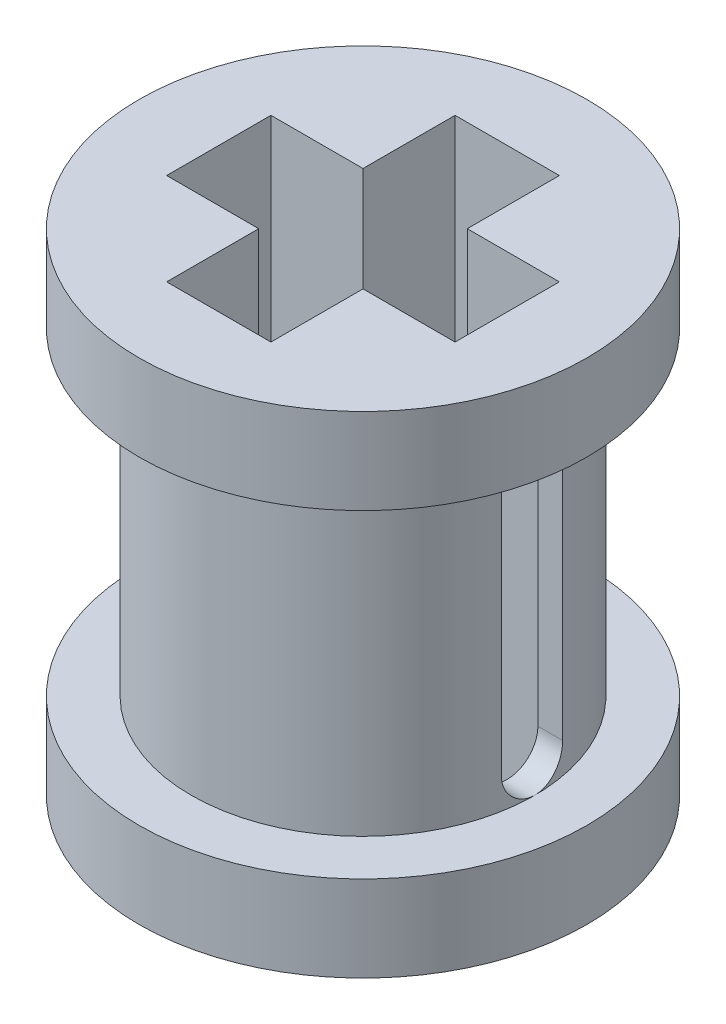
ISO-10303-21;
HEADER;
FILE_DESCRIPTION(('STEP AP214'),'2;1');
FILE_NAME('part.step','',(''),(''),'','','');
FILE_SCHEMA(('AUTOMOTIVE_DESIGN { 1 0 10303 214 1 1 1 1 }'));
ENDSEC;
DATA;
#1=APPLICATION_CONTEXT('core data for automotive mechanical design processes');
#2=APPLICATION_PROTOCOL_DEFINITION('international standard','automotive_design',2000,#1);
#3=PRODUCT_CONTEXT('',#1,'mechanical');
#4=PRODUCT('Part','Part','',(#3));
#5=PRODUCT_RELATED_PRODUCT_CATEGORY('part','',(#4));
#6=PRODUCT_DEFINITION_FORMATION('','',#4);
#7=PRODUCT_DEFINITION_CONTEXT('part definition',#1,'design');
#8=PRODUCT_DEFINITION('design','',#6,#7);
#9=PRODUCT_DEFINITION_SHAPE('','',#8);
#10=(LENGTH_UNIT() NAMED_UNIT(*) SI_UNIT(.MILLI.,.METRE.));
#11=(NAMED_UNIT(*) PLANE_ANGLE_UNIT() SI_UNIT($,.RADIAN.));
#12=(NAMED_UNIT(*) SI_UNIT($,.STERADIAN.) SOLID_ANGLE_UNIT());
#13=UNCERTAINTY_MEASURE_WITH_UNIT(LENGTH_MEASURE(1.E-05),#10,'distance_accuracy_value','');
#14=(GEOMETRIC_REPRESENTATION_CONTEXT(3) GLOBAL_UNCERTAINTY_ASSIGNED_CONTEXT((#13)) GLOBAL_UNIT_ASSIGNED_CONTEXT((#10,
#11,#12)) REPRESENTATION_CONTEXT('',''));
#15=CARTESIAN_POINT('',(0.,0.,0.));
#16=DIRECTION('',(0.,0.,1.));
#17=DIRECTION('',(1.,0.,0.));
#18=AXIS2_PLACEMENT_3D('',#15,#16,#17);
#19=CARTESIAN_POINT('',(0.,1.4,0.));
#20=DIRECTION('',(0.,-1.,0.));
#21=DIRECTION('',(0.,0.,-1.));
#22=AXIS2_PLACEMENT_3D('',#19,#20,#21);
#23=CYLINDRICAL_SURFACE('',#22,3.65);
#24=CARTESIAN_POINT('',(0.,1.4,0.));
#25=DIRECTION('',(0.,1.,0.));
#26=DIRECTION('',(0.,0.,1.));
#27=AXIS2_PLACEMENT_3D('',#24,#25,#26);
#28=CIRCLE('',#27,3.65);
#29=CARTESIAN_POINT('',(0.,1.4,3.65));
#30=VERTEX_POINT('',#29);
#31=EDGE_CURVE('E368',#30,#30,#28,.T.);
#32=ORIENTED_EDGE('',*,*,#31,.F.);
#33=EDGE_LOOP('',(#32));
#34=FACE_BOUND('',#33,.T.);
#35=CARTESIAN_POINT('',(0.,0.,0.));
#36=DIRECTION('',(0.,1.,0.));
#37=DIRECTION('',(0.,0.,1.));
#38=AXIS2_PLACEMENT_3D('',#35,#36,#37);
#39=CIRCLE('',#38,3.65);
#40=CARTESIAN_POINT('',(0.,0.,3.65));
#41=VERTEX_POINT('',#40);
#42=EDGE_CURVE('E371',#41,#41,#39,.T.);
#43=ORIENTED_EDGE('',*,*,#42,.T.);
#44=EDGE_LOOP('',(#43));
#45=FACE_BOUND('',#44,.T.);
#46=ADVANCED_FACE('F104',(#34,#45),#23,.T.);
#47=CARTESIAN_POINT('',(0.,1.4,0.));
#48=DIRECTION('',(0.,1.,0.));
#49=DIRECTION('',(0.,0.,1.));
#50=AXIS2_PLACEMENT_3D('',#47,#48,#49);
#51=PLANE('',#50);
#52=CARTESIAN_POINT('',(0.,1.4,0.));
#53=DIRECTION('',(0.,1.,0.));
#54=DIRECTION('',(0.,0.,1.));
#55=AXIS2_PLACEMENT_3D('',#52,#53,#54);
#56=CIRCLE('',#55,2.8);
#57=CARTESIAN_POINT('',(0.,1.4,2.8));
#58=VERTEX_POINT('',#57);
#59=EDGE_CURVE('E375',#58,#58,#56,.T.);
#60=ORIENTED_EDGE('',*,*,#59,.F.);
#61=EDGE_LOOP('',(#60));
#62=FACE_BOUND('',#61,.T.);
#63=ORIENTED_EDGE('',*,*,#31,.T.);
#64=EDGE_LOOP('',(#63));
#65=FACE_BOUND('',#64,.T.);
#66=ADVANCED_FACE('F359',(#62,#65),#51,.T.);
#67=CARTESIAN_POINT('',(0.,0.,0.));
#68=DIRECTION('',(0.,1.,0.));
#69=DIRECTION('',(0.,0.,1.));
#70=AXIS2_PLACEMENT_3D('',#67,#68,#69);
#71=PLANE('',#70);
#72=DIRECTION('',(1.,0.,0.));
#73=VECTOR('',#72,1.);
#74=CARTESIAN_POINT('',(0.,0.,-0.85));
#75=LINE('',#74,#73);
#76=CARTESIAN_POINT('',(-2.35106358910175,0.,-0.85));
#77=VERTEX_POINT('',#76);
#78=CARTESIAN_POINT('',(-0.85,0.,-0.85));
#79=VERTEX_POINT('',#78);
#80=EDGE_CURVE('E531',#77,#79,#75,.T.);
#81=ORIENTED_EDGE('',*,*,#80,.F.);
#82=DIRECTION('',(0.,0.,1.));
#83=VECTOR('',#82,1.);
#84=CARTESIAN_POINT('',(-2.35106358910175,0.,0.));
#85=LINE('',#84,#83);
#86=CARTESIAN_POINT('',(-2.35106358910175,0.,0.85));
#87=VERTEX_POINT('',#86);
#88=EDGE_CURVE('E528',#77,#87,#85,.T.);
#89=ORIENTED_EDGE('',*,*,#88,.T.);
#90=DIRECTION('',(1.,0.,0.));
#91=VECTOR('',#90,1.);
#92=CARTESIAN_POINT('',(0.,0.,0.85));
#93=LINE('',#92,#91);
#94=CARTESIAN_POINT('',(-0.85,0.,0.85));
#95=VERTEX_POINT('',#94);
#96=EDGE_CURVE('E525',#87,#95,#93,.T.);
#97=ORIENTED_EDGE('',*,*,#96,.T.);
#98=DIRECTION('',(0.,0.,-1.));
#99=VECTOR('',#98,1.);
#100=CARTESIAN_POINT('',(-0.85,0.,0.));
#101=LINE('',#100,#99);
#102=CARTESIAN_POINT('',(-0.85,0.,2.35106358910175));
#103=VERTEX_POINT('',#102);
#104=EDGE_CURVE('E523',#103,#95,#101,.T.);
#105=ORIENTED_EDGE('',*,*,#104,.F.);
#106=DIRECTION('',(-1.,0.,0.));
#107=VECTOR('',#106,1.);
#108=CARTESIAN_POINT('',(0.,0.,2.35106358910175));
#109=LINE('',#108,#107);
#110=CARTESIAN_POINT('',(0.85,0.,2.35106358910175));
#111=VERTEX_POINT('',#110);
#112=EDGE_CURVE('E464',#111,#103,#109,.T.);
#113=ORIENTED_EDGE('',*,*,#112,.F.);
#114=DIRECTION('',(0.,0.,-1.));
#115=VECTOR('',#114,1.);
#116=CARTESIAN_POINT('',(0.85,0.,0.));
#117=LINE('',#116,#115);
#118=CARTESIAN_POINT('',(0.85,0.,0.85));
#119=VERTEX_POINT('',#118);
#120=EDGE_CURVE('E489',#111,#119,#117,.T.);
#121=ORIENTED_EDGE('',*,*,#120,.T.);
#122=DIRECTION('',(1.,0.,0.));
#123=VECTOR('',#122,1.);
#124=CARTESIAN_POINT('',(0.,0.,0.85));
#125=LINE('',#124,#123);
#126=CARTESIAN_POINT('',(2.35106358910175,0.,0.85));
#127=VERTEX_POINT('',#126);
#128=EDGE_CURVE('E545',#119,#127,#125,.T.);
#129=ORIENTED_EDGE('',*,*,#128,.T.);
#130=DIRECTION('',(0.,0.,1.));
#131=VECTOR('',#130,1.);
#132=CARTESIAN_POINT('',(2.35106358910175,0.,0.));
#133=LINE('',#132,#131);
#134=CARTESIAN_POINT('',(2.35106358910175,0.,-0.85));
#135=VERTEX_POINT('',#134);
#136=EDGE_CURVE('E543',#135,#127,#133,.T.);
#137=ORIENTED_EDGE('',*,*,#136,.F.);
#138=DIRECTION('',(1.,0.,0.));
#139=VECTOR('',#138,1.);
#140=CARTESIAN_POINT('',(0.,0.,-0.85));
#141=LINE('',#140,#139);
#142=CARTESIAN_POINT('',(0.85,0.,-0.85));
#143=VERTEX_POINT('',#142);
#144=EDGE_CURVE('E541',#143,#135,#141,.T.);
#145=ORIENTED_EDGE('',*,*,#144,.F.);
#146=DIRECTION('',(0.,0.,-1.));
#147=VECTOR('',#146,1.);
#148=CARTESIAN_POINT('',(0.85,0.,0.));
#149=LINE('',#148,#147);
#150=CARTESIAN_POINT('',(0.85,0.,-2.35106358910175));
#151=VERTEX_POINT('',#150);
#152=EDGE_CURVE('E538',#143,#151,#149,.T.);
#153=ORIENTED_EDGE('',*,*,#152,.T.);
#154=DIRECTION('',(-1.,0.,0.));
#155=VECTOR('',#154,1.);
#156=CARTESIAN_POINT('',(0.,0.,-2.35106358910175));
#157=LINE('',#156,#155);
#158=CARTESIAN_POINT('',(-0.85,0.,-2.35106358910175));
#159=VERTEX_POINT('',#158);
#160=EDGE_CURVE('E535',#151,#159,#157,.T.);
#161=ORIENTED_EDGE('',*,*,#160,.T.);
#162=DIRECTION('',(0.,0.,-1.));
#163=VECTOR('',#162,1.);
#164=CARTESIAN_POINT('',(-0.85,0.,0.));
#165=LINE('',#164,#163);
#166=EDGE_CURVE('E533',#79,#159,#165,.T.);
#167=ORIENTED_EDGE('',*,*,#166,.F.);
#168=EDGE_LOOP('',(#81,#89,#97,#105,#113,#121,#129,#137,#145,#153,#161,#167));
#169=FACE_BOUND('',#168,.T.);
#170=ORIENTED_EDGE('',*,*,#42,.F.);
#171=EDGE_LOOP('',(#170));
#172=FACE_BOUND('',#171,.T.);
#173=ADVANCED_FACE('F355',(#169,#172),#71,.F.);
#174=CARTESIAN_POINT('',(0.,6.6,0.));
#175=DIRECTION('',(0.,-1.,0.));
#176=DIRECTION('',(0.,0.,-1.));
#177=AXIS2_PLACEMENT_3D('',#174,#175,#176);
#178=CYLINDRICAL_SURFACE('',#177,2.8);
#179=DIRECTION('',(0.,-1.,0.));
#180=VECTOR('',#179,1.);
#181=CARTESIAN_POINT('',(-2.75499546279118,6.6,-0.499999999999999));
#182=LINE('',#181,#180);
#183=CARTESIAN_POINT('',(-2.75499546279118,1.90133463433287,-0.5));
#184=VERTEX_POINT('',#183);
#185=CARTESIAN_POINT('',(-2.75499546279118,6.09866536566713,-0.499999999999999));
#186=VERTEX_POINT('',#185);
#187=EDGE_CURVE('E261',#184,#186,#182,.F.);
#188=ORIENTED_EDGE('',*,*,#187,.T.);
#189=CARTESIAN_POINT('',(-2.75499546279118,6.09866536566713,-0.499999999999999));
#190=CARTESIAN_POINT('',(-2.75497887205901,6.12655658347319,-0.500024938224864));
#191=CARTESIAN_POINT('',(-2.7554185685824,6.15443554412663,-0.497667853212735));
#192=CARTESIAN_POINT('',(-2.75708629996074,6.20935838189249,-0.488379825856461));
#193=CARTESIAN_POINT('',(-2.75831323259685,6.23640337125773,-0.481455278093242));
#194=CARTESIAN_POINT('',(-2.7614321277351,6.28893474667129,-0.46321988039961));
#195=CARTESIAN_POINT('',(-2.76332421195943,6.31442084644124,-0.451908227593429));
#196=CARTESIAN_POINT('',(-2.76755431171236,6.36313611251217,-0.425236441375134));
#197=CARTESIAN_POINT('',(-2.76989234667835,6.38636518037061,-0.40987613148546));
#198=CARTESIAN_POINT('',(-2.77478135288023,6.43016382949557,-0.375358591948535));
#199=CARTESIAN_POINT('',(-2.77733422045528,6.4507044783249,-0.356164912754774));
#200=CARTESIAN_POINT('',(-2.78234840445687,6.4882938941979,-0.314602640152096));
#201=CARTESIAN_POINT('',(-2.78480970675806,6.50534212429504,-0.292233559430573));
#202=CARTESIAN_POINT('',(-2.78938364020792,6.53557114060679,-0.244766016599119));
#203=CARTESIAN_POINT('',(-2.79149376054344,6.5487245606168,-0.219649863971788));
#204=CARTESIAN_POINT('',(-2.79510610672799,6.57061380439711,-0.167521833705497));
#205=CARTESIAN_POINT('',(-2.79660841194082,6.57935020494486,-0.140510204104075));
#206=CARTESIAN_POINT('',(-2.79882254164239,6.59206858906919,-0.0856590585031865));
#207=CARTESIAN_POINT('',(-2.79954253765568,6.59609975432187,-0.0578312816256739));
#208=CARTESIAN_POINT('',(-2.80013905725202,6.59944636675769,-0.00188501169272974));
#209=CARTESIAN_POINT('',(-2.80001562639277,6.59876206864656,0.0262334655786034));
#210=CARTESIAN_POINT('',(-2.79894559054094,6.5927350053538,0.0816246904800355));
#211=CARTESIAN_POINT('',(-2.79800836309283,6.58744530727771,0.108903419510395));
#212=CARTESIAN_POINT('',(-2.79542653943881,6.57244140100535,0.162179577457163));
#213=CARTESIAN_POINT('',(-2.79378192400253,6.56272707252498,0.188176971519039));
#214=CARTESIAN_POINT('',(-2.78995427620722,6.53909796549474,0.238308749814554));
#215=CARTESIAN_POINT('',(-2.78776848935476,6.5251616136037,0.262432746718429));
#216=CARTESIAN_POINT('',(-2.78310083586276,6.4935003774328,0.308018795350735));
#217=CARTESIAN_POINT('',(-2.78061895233085,6.47577527695843,0.329480695063438));
#218=CARTESIAN_POINT('',(-2.77559395801606,6.43674910195716,0.369445762315454));
#219=CARTESIAN_POINT('',(-2.77305047493893,6.41540205799158,0.387904016098364));
#220=CARTESIAN_POINT('',(-2.76822113622519,6.36988366146683,0.420989630724439));
#221=CARTESIAN_POINT('',(-2.76593535332235,6.34571151544674,0.435615911558823));
#222=CARTESIAN_POINT('',(-2.76187947153686,6.29516937063141,0.460633643725038));
#223=CARTESIAN_POINT('',(-2.7601104088113,6.26879509025315,0.471016602511347));
#224=CARTESIAN_POINT('',(-2.75730426277419,6.2146556408155,0.487177194202711));
#225=CARTESIAN_POINT('',(-2.7562660871395,6.18689261406202,0.492961701250494));
#226=CARTESIAN_POINT('',(-2.75543456740347,6.1488731677646,0.497575256053474));
#227=CARTESIAN_POINT('',(-2.75527006132675,6.13884502843584,0.498484893948501));
#228=CARTESIAN_POINT('',(-2.75505061343132,6.11876785872478,0.499696483824883));
#229=CARTESIAN_POINT('',(-2.75499548747878,6.10871889200859,0.499999457091805));
#230=CARTESIAN_POINT('',(-2.75499546279119,6.09866536566713,0.5));
#231=B_SPLINE_CURVE_WITH_KNOTS('',3,(#189,#190,#191,#192,#193,#194,#195,#196,#197,#198,#199,
#200,#201,#202,#203,#204,#205,#206,#207,#208,#209,#210,#211,#212,#213,#214,#215,#216,#217,#218,
#219,#220,#221,#222,#223,#224,#225,#226,#227,#228,#229,#230),.UNSPECIFIED.,.F.,.F.,(4,2,2,2,2,2,
2,2,2,2,2,2,2,2,2,2,2,2,2,2,4),(0.,0.0835523080036198,0.166987887921846,0.250438744437804,
0.333893239108228,0.418182670449917,0.502485051271318,0.587366429986767,0.672236721968821,
0.756211725962619,0.84018219408281,0.923197704714185,1.00621547226653,1.08966480414763,
1.17311889910675,1.25772456770494,1.34235405609703,1.42715210133808,1.5118231438752,
1.542020788702,1.57216755461931),.UNSPECIFIED.);
#232=CARTESIAN_POINT('',(-2.75499546279118,6.09866536566713,0.5));
#233=VERTEX_POINT('',#232);
#234=EDGE_CURVE('E251',#186,#233,#231,.T.);
#235=ORIENTED_EDGE('',*,*,#234,.T.);
#236=DIRECTION('',(0.,-1.,0.));
#237=VECTOR('',#236,1.);
#238=CARTESIAN_POINT('',(-2.75499546279118,6.6,0.5));
#239=LINE('',#238,#237);
#240=CARTESIAN_POINT('',(-2.75499546279118,1.90133463433287,0.5));
#241=VERTEX_POINT('',#240);
#242=EDGE_CURVE('E237',#233,#241,#239,.T.);
#243=ORIENTED_EDGE('',*,*,#242,.T.);
#244=CARTESIAN_POINT('',(-2.75499546279118,1.90133463433287,0.499999999999999));
#245=CARTESIAN_POINT('',(-2.75497887205901,1.87344341652681,0.500024938224864));
#246=CARTESIAN_POINT('',(-2.7554185685824,1.84556445587337,0.497667853212736));
#247=CARTESIAN_POINT('',(-2.75708629996074,1.79064161810751,0.488379825856461));
#248=CARTESIAN_POINT('',(-2.75831323259685,1.76359662874227,0.481455278093242));
#249=CARTESIAN_POINT('',(-2.7614321277351,1.71106525332871,0.46321988039961));
#250=CARTESIAN_POINT('',(-2.76332421195943,1.68557915355876,0.451908227593429));
#251=CARTESIAN_POINT('',(-2.76755431171236,1.63686388748783,0.425236441375134));
#252=CARTESIAN_POINT('',(-2.76989234667835,1.61363481962939,0.40987613148546));
#253=CARTESIAN_POINT('',(-2.77478135288023,1.56983617050443,0.375358591948535));
#254=CARTESIAN_POINT('',(-2.77733422045528,1.5492955216751,0.356164912754774));
#255=CARTESIAN_POINT('',(-2.78234840445687,1.51170610580211,0.314602640152096));
#256=CARTESIAN_POINT('',(-2.78480970675806,1.49465787570496,0.292233559430573));
#257=CARTESIAN_POINT('',(-2.78938364020792,1.46442885939321,0.244766016599119));
#258=CARTESIAN_POINT('',(-2.79149376054344,1.4512754393832,0.219649863971788));
#259=CARTESIAN_POINT('',(-2.79510610672799,1.42938619560289,0.167521833705497));
#260=CARTESIAN_POINT('',(-2.79660841194082,1.42064979505514,0.140510204104075));
#261=CARTESIAN_POINT('',(-2.79882254164239,1.40793141093081,0.0856590585031866));
#262=CARTESIAN_POINT('',(-2.79954253765568,1.40390024567813,0.0578312816256741));
#263=CARTESIAN_POINT('',(-2.80013905725202,1.40055363324231,0.00188501169272991));
#264=CARTESIAN_POINT('',(-2.80001562639277,1.40123793135344,-0.0262334655786032));
#265=CARTESIAN_POINT('',(-2.79894559054094,1.4072649946462,-0.0816246904800353));
#266=CARTESIAN_POINT('',(-2.79800836309283,1.41255469272229,-0.108903419510395));
#267=CARTESIAN_POINT('',(-2.79542653943881,1.42755859899465,-0.162179577457163));
#268=CARTESIAN_POINT('',(-2.79378192400253,1.43727292747502,-0.188176971519039));
#269=CARTESIAN_POINT('',(-2.78995427620722,1.46090203450526,-0.238308749814554));
#270=CARTESIAN_POINT('',(-2.78776848935476,1.4748383863963,-0.262432746718428));
#271=CARTESIAN_POINT('',(-2.78310083586276,1.5064996225672,-0.308018795350735));
#272=CARTESIAN_POINT('',(-2.78061895233085,1.52422472304157,-0.329480695063438));
#273=CARTESIAN_POINT('',(-2.77559395801606,1.56325089804284,-0.369445762315454));
#274=CARTESIAN_POINT('',(-2.77305047493893,1.58459794200842,-0.387904016098363));
#275=CARTESIAN_POINT('',(-2.76822113622519,1.63011633853317,-0.420989630724438));
#276=CARTESIAN_POINT('',(-2.76593535332235,1.65428848455325,-0.435615911558823));
#277=CARTESIAN_POINT('',(-2.76187947153686,1.70483062936859,-0.460633643725037));
#278=CARTESIAN_POINT('',(-2.7601104088113,1.73120490974686,-0.471016602511347));
#279=CARTESIAN_POINT('',(-2.75730426277419,1.7853443591845,-0.487177194202711));
#280=CARTESIAN_POINT('',(-2.7562660871395,1.81310738593798,-0.492961701250494));
#281=CARTESIAN_POINT('',(-2.75543456740347,1.8511268322354,-0.497575256053474));
#282=CARTESIAN_POINT('',(-2.75527006132675,1.86115497156416,-0.498484893948501));
#283=CARTESIAN_POINT('',(-2.75505061343132,1.88123214127522,-0.499696483824883));
#284=CARTESIAN_POINT('',(-2.75499548747878,1.89128110799141,-0.499999457091805));
#285=CARTESIAN_POINT('',(-2.75499546279119,1.90133463433287,-0.5));
#286=B_SPLINE_CURVE_WITH_KNOTS('',3,(#244,#245,#246,#247,#248,#249,#250,#251,#252,#253,#254,
#255,#256,#257,#258,#259,#260,#261,#262,#263,#264,#265,#266,#267,#268,#269,#270,#271,#272,#273,
#274,#275,#276,#277,#278,#279,#280,#281,#282,#283,#284,#285),.UNSPECIFIED.,.F.,.F.,(4,2,2,2,2,2,
2,2,2,2,2,2,2,2,2,2,2,2,2,2,4),(0.,0.0835523080036202,0.166987887921846,0.250438744437804,
0.333893239108228,0.418182670449917,0.502485051271318,0.587366429986766,0.672236721968821,
0.756211725962619,0.84018219408281,0.923197704714185,1.00621547226653,1.08966480414763,
1.17311889910675,1.25772456770494,1.34235405609703,1.42715210133808,1.5118231438752,
1.54202078870201,1.57216755461931),.UNSPECIFIED.);
#287=EDGE_CURVE('E415',#241,#184,#286,.T.);
#288=ORIENTED_EDGE('',*,*,#287,.T.);
#289=EDGE_LOOP('',(#188,#235,#243,#288));
#290=FACE_BOUND('',#289,.T.);
#291=DIRECTION('',(0.,-1.,0.));
#292=VECTOR('',#291,1.);
#293=CARTESIAN_POINT('',(2.75499546279118,6.6,0.5));
#294=LINE('',#293,#292);
#295=CARTESIAN_POINT('',(2.75499546279118,1.90133463433287,0.499999999999999));
#296=VERTEX_POINT('',#295);
#297=CARTESIAN_POINT('',(2.75499546279118,6.09866536566713,0.5));
#298=VERTEX_POINT('',#297);
#299=EDGE_CURVE('E246',#296,#298,#294,.F.);
#300=ORIENTED_EDGE('',*,*,#299,.T.);
#301=CARTESIAN_POINT('',(2.75499546279118,6.09866536566713,0.499999999999999));
#302=CARTESIAN_POINT('',(2.75497887205901,6.12655658347319,0.500024938224864));
#303=CARTESIAN_POINT('',(2.7554185685824,6.15443554412663,0.497667853212735));
#304=CARTESIAN_POINT('',(2.75708629996074,6.20935838189249,0.488379825856461));
#305=CARTESIAN_POINT('',(2.75831323259685,6.23640337125773,0.481455278093242));
#306=CARTESIAN_POINT('',(2.7614321277351,6.28893474667129,0.46321988039961));
#307=CARTESIAN_POINT('',(2.76332421195943,6.31442084644124,0.451908227593429));
#308=CARTESIAN_POINT('',(2.76755431171236,6.36313611251217,0.425236441375134));
#309=CARTESIAN_POINT('',(2.76989234667835,6.38636518037061,0.40987613148546));
#310=CARTESIAN_POINT('',(2.77478135288023,6.43016382949557,0.375358591948535));
#311=CARTESIAN_POINT('',(2.77733422045528,6.4507044783249,0.356164912754774));
#312=CARTESIAN_POINT('',(2.78234840445687,6.4882938941979,0.314602640152096));
#313=CARTESIAN_POINT('',(2.78480970675806,6.50534212429504,0.292233559430573));
#314=CARTESIAN_POINT('',(2.78938364020792,6.53557114060679,0.244766016599119));
#315=CARTESIAN_POINT('',(2.79149376054344,6.5487245606168,0.219649863971788));
#316=CARTESIAN_POINT('',(2.79510610672799,6.57061380439711,0.167521833705497));
#317=CARTESIAN_POINT('',(2.79660841194082,6.57935020494486,0.140510204104075));
#318=CARTESIAN_POINT('',(2.79882254164239,6.59206858906919,0.0856590585031865));
#319=CARTESIAN_POINT('',(2.79954253765568,6.59609975432187,0.0578312816256739));
#320=CARTESIAN_POINT('',(2.80013905725202,6.59944636675769,0.00188501169272974));
#321=CARTESIAN_POINT('',(2.80001562639277,6.59876206864656,-0.0262334655786034));
#322=CARTESIAN_POINT('',(2.79894559054094,6.5927350053538,-0.0816246904800355));
#323=CARTESIAN_POINT('',(2.79800836309283,6.58744530727771,-0.108903419510395));
#324=CARTESIAN_POINT('',(2.79542653943881,6.57244140100535,-0.162179577457163));
#325=CARTESIAN_POINT('',(2.79378192400253,6.56272707252498,-0.188176971519039));
#326=CARTESIAN_POINT('',(2.78995427620722,6.53909796549474,-0.238308749814554));
#327=CARTESIAN_POINT('',(2.78776848935476,6.5251616136037,-0.262432746718429));
#328=CARTESIAN_POINT('',(2.78310083586276,6.4935003774328,-0.308018795350735));
#329=CARTESIAN_POINT('',(2.78061895233085,6.47577527695843,-0.329480695063438));
#330=CARTESIAN_POINT('',(2.77559395801606,6.43674910195716,-0.369445762315454));
#331=CARTESIAN_POINT('',(2.77305047493893,6.41540205799158,-0.387904016098364));
#332=CARTESIAN_POINT('',(2.76822113622519,6.36988366146683,-0.420989630724439));
#333=CARTESIAN_POINT('',(2.76593535332235,6.34571151544674,-0.435615911558823));
#334=CARTESIAN_POINT('',(2.76187947153686,6.29516937063141,-0.460633643725038));
#335=CARTESIAN_POINT('',(2.7601104088113,6.26879509025315,-0.471016602511347));
#336=CARTESIAN_POINT('',(2.75730426277419,6.2146556408155,-0.487177194202711));
#337=CARTESIAN_POINT('',(2.7562660871395,6.18689261406202,-0.492961701250494));
#338=CARTESIAN_POINT('',(2.75543456740347,6.1488731677646,-0.497575256053474));
#339=CARTESIAN_POINT('',(2.75527006132675,6.13884502843584,-0.498484893948501));
#340=CARTESIAN_POINT('',(2.75505061343132,6.11876785872478,-0.499696483824883));
#341=CARTESIAN_POINT('',(2.75499548747878,6.10871889200859,-0.499999457091805));
#342=CARTESIAN_POINT('',(2.75499546279119,6.09866536566713,-0.5));
#343=B_SPLINE_CURVE_WITH_KNOTS('',3,(#301,#302,#303,#304,#305,#306,#307,#308,#309,#310,#311,
#312,#313,#314,#315,#316,#317,#318,#319,#320,#321,#322,#323,#324,#325,#326,#327,#328,#329,#330,
#331,#332,#333,#334,#335,#336,#337,#338,#339,#340,#341,#342),.UNSPECIFIED.,.F.,.F.,(4,2,2,2,2,2,
2,2,2,2,2,2,2,2,2,2,2,2,2,2,4),(0.,0.0835523080036198,0.166987887921846,0.250438744437804,
0.333893239108228,0.418182670449917,0.502485051271318,0.587366429986767,0.672236721968821,
0.756211725962619,0.84018219408281,0.923197704714185,1.00621547226653,1.08966480414763,
1.17311889910675,1.25772456770494,1.34235405609703,1.42715210133808,1.5118231438752,
1.542020788702,1.57216755461931),.UNSPECIFIED.);
#344=CARTESIAN_POINT('',(2.75499546279118,6.09866536566713,-0.499999999999999));
#345=VERTEX_POINT('',#344);
#346=EDGE_CURVE('E262',#298,#345,#343,.T.);
#347=ORIENTED_EDGE('',*,*,#346,.T.);
#348=DIRECTION('',(0.,-1.,0.));
#349=VECTOR('',#348,1.);
#350=CARTESIAN_POINT('',(2.75499546279118,6.6,-0.499999999999999));
#351=LINE('',#350,#349);
#352=CARTESIAN_POINT('',(2.75499546279118,1.90133463433287,-0.5));
#353=VERTEX_POINT('',#352);
#354=EDGE_CURVE('E267',#345,#353,#351,.T.);
#355=ORIENTED_EDGE('',*,*,#354,.T.);
#356=CARTESIAN_POINT('',(2.75499546279118,1.90133463433287,-0.499999999999999));
#357=CARTESIAN_POINT('',(2.75497887205901,1.87344341652681,-0.500024938224864));
#358=CARTESIAN_POINT('',(2.7554185685824,1.84556445587337,-0.497667853212736));
#359=CARTESIAN_POINT('',(2.75708629996074,1.79064161810751,-0.488379825856461));
#360=CARTESIAN_POINT('',(2.75831323259685,1.76359662874227,-0.481455278093242));
#361=CARTESIAN_POINT('',(2.7614321277351,1.71106525332871,-0.46321988039961));
#362=CARTESIAN_POINT('',(2.76332421195943,1.68557915355876,-0.451908227593429));
#363=CARTESIAN_POINT('',(2.76755431171236,1.63686388748783,-0.425236441375134));
#364=CARTESIAN_POINT('',(2.76989234667835,1.61363481962939,-0.40987613148546));
#365=CARTESIAN_POINT('',(2.77478135288023,1.56983617050443,-0.375358591948535));
#366=CARTESIAN_POINT('',(2.77733422045528,1.5492955216751,-0.356164912754774));
#367=CARTESIAN_POINT('',(2.78234840445687,1.51170610580211,-0.314602640152097));
#368=CARTESIAN_POINT('',(2.78480970675806,1.49465787570496,-0.292233559430573));
#369=CARTESIAN_POINT('',(2.78938364020792,1.46442885939321,-0.24476601659912));
#370=CARTESIAN_POINT('',(2.79149376054344,1.4512754393832,-0.219649863971789));
#371=CARTESIAN_POINT('',(2.79510610672799,1.42938619560289,-0.167521833705498));
#372=CARTESIAN_POINT('',(2.79660841194082,1.42064979505514,-0.140510204104075));
#373=CARTESIAN_POINT('',(2.79882254164239,1.40793141093081,-0.0856590585031872));
#374=CARTESIAN_POINT('',(2.79954253765568,1.40390024567813,-0.0578312816256746));
#375=CARTESIAN_POINT('',(2.80013905725202,1.40055363324231,-0.00188501169273041));
#376=CARTESIAN_POINT('',(2.80001562639277,1.40123793135344,0.0262334655786027));
#377=CARTESIAN_POINT('',(2.79894559054094,1.4072649946462,0.0816246904800348));
#378=CARTESIAN_POINT('',(2.79800836309283,1.41255469272229,0.108903419510394));
#379=CARTESIAN_POINT('',(2.79542653943881,1.42755859899465,0.162179577457163));
#380=CARTESIAN_POINT('',(2.79378192400253,1.43727292747502,0.188176971519038));
#381=CARTESIAN_POINT('',(2.78995427620722,1.46090203450526,0.238308749814554));
#382=CARTESIAN_POINT('',(2.78776848935476,1.4748383863963,0.262432746718428));
#383=CARTESIAN_POINT('',(2.78310083586276,1.5064996225672,0.308018795350734));
#384=CARTESIAN_POINT('',(2.78061895233085,1.52422472304157,0.329480695063437));
#385=CARTESIAN_POINT('',(2.77559395801606,1.56325089804284,0.369445762315453));
#386=CARTESIAN_POINT('',(2.77305047493893,1.58459794200842,0.387904016098363));
#387=CARTESIAN_POINT('',(2.76822113622519,1.63011633853317,0.420989630724438));
#388=CARTESIAN_POINT('',(2.76593535332235,1.65428848455325,0.435615911558822));
#389=CARTESIAN_POINT('',(2.76187947153686,1.70483062936859,0.460633643725037));
#390=CARTESIAN_POINT('',(2.7601104088113,1.73120490974685,0.471016602511347));
#391=CARTESIAN_POINT('',(2.75730426277419,1.7853443591845,0.487177194202711));
#392=CARTESIAN_POINT('',(2.7562660871395,1.81310738593798,0.492961701250494));
#393=CARTESIAN_POINT('',(2.75543456740347,1.8511268322354,0.497575256053474));
#394=CARTESIAN_POINT('',(2.75527006132675,1.86115497156416,0.498484893948501));
#395=CARTESIAN_POINT('',(2.75505061343132,1.88123214127522,0.499696483824883));
#396=CARTESIAN_POINT('',(2.75499548747878,1.89128110799141,0.499999457091805));
#397=CARTESIAN_POINT('',(2.75499546279119,1.90133463433287,0.5));
#398=B_SPLINE_CURVE_WITH_KNOTS('',3,(#356,#357,#358,#359,#360,#361,#362,#363,#364,#365,#366,
#367,#368,#369,#370,#371,#372,#373,#374,#375,#376,#377,#378,#379,#380,#381,#382,#383,#384,#385,
#386,#387,#388,#389,#390,#391,#392,#393,#394,#395,#396,#397),.UNSPECIFIED.,.F.,.F.,(4,2,2,2,2,2,
2,2,2,2,2,2,2,2,2,2,2,2,2,2,4),(0.,0.08355230800362,0.166987887921846,0.250438744437804,
0.333893239108228,0.418182670449916,0.502485051271317,0.587366429986766,0.672236721968821,
0.756211725962618,0.840182194082809,0.923197704714184,1.00621547226653,1.08966480414763,
1.17311889910675,1.25772456770494,1.34235405609703,1.42715210133808,1.5118231438752,
1.54202078870201,1.57216755461931),.UNSPECIFIED.);
#399=EDGE_CURVE('E402',#353,#296,#398,.T.);
#400=ORIENTED_EDGE('',*,*,#399,.T.);
#401=EDGE_LOOP('',(#300,#347,#355,#400));
#402=FACE_BOUND('',#401,.T.);
#403=CARTESIAN_POINT('',(0.,6.6,0.));
#404=DIRECTION('',(0.,1.,0.));
#405=DIRECTION('',(0.,0.,1.));
#406=AXIS2_PLACEMENT_3D('',#403,#404,#405);
#407=CIRCLE('',#406,2.8);
#408=CARTESIAN_POINT('',(0.,6.6,2.8));
#409=VERTEX_POINT('',#408);
#410=EDGE_CURVE('E373',#409,#409,#407,.T.);
#411=ORIENTED_EDGE('',*,*,#410,.F.);
#412=EDGE_LOOP('',(#411));
#413=FACE_BOUND('',#412,.T.);
#414=ORIENTED_EDGE('',*,*,#59,.T.);
#415=EDGE_LOOP('',(#414));
#416=FACE_BOUND('',#415,.T.);
#417=ADVANCED_FACE('F259',(#290,#402,#413,#416),#178,.T.);
#418=CARTESIAN_POINT('',(0.,8.,0.));
#419=DIRECTION('',(0.,-1.,0.));
#420=DIRECTION('',(0.,0.,-1.));
#421=AXIS2_PLACEMENT_3D('',#418,#419,#420);
#422=CYLINDRICAL_SURFACE('',#421,3.65);
#423=CARTESIAN_POINT('',(0.,8.,0.));
#424=DIRECTION('',(0.,1.,0.));
#425=DIRECTION('',(0.,0.,1.));
#426=AXIS2_PLACEMENT_3D('',#423,#424,#425);
#427=CIRCLE('',#426,3.65);
#428=CARTESIAN_POINT('',(0.,8.,3.65));
#429=VERTEX_POINT('',#428);
#430=EDGE_CURVE('E378',#429,#429,#427,.T.);
#431=ORIENTED_EDGE('',*,*,#430,.F.);
#432=EDGE_LOOP('',(#431));
#433=FACE_BOUND('',#432,.T.);
#434=CARTESIAN_POINT('',(0.,6.6,0.));
#435=DIRECTION('',(0.,1.,0.));
#436=DIRECTION('',(0.,0.,1.));
#437=AXIS2_PLACEMENT_3D('',#434,#435,#436);
#438=CIRCLE('',#437,3.65);
#439=CARTESIAN_POINT('',(0.,6.6,3.65));
#440=VERTEX_POINT('',#439);
#441=EDGE_CURVE('E455',#440,#440,#438,.T.);
#442=ORIENTED_EDGE('',*,*,#441,.T.);
#443=EDGE_LOOP('',(#442));
#444=FACE_BOUND('',#443,.T.);
#445=ADVANCED_FACE('F346',(#433,#444),#422,.T.);
#446=CARTESIAN_POINT('',(0.,8.,0.));
#447=DIRECTION('',(0.,1.,0.));
#448=DIRECTION('',(0.,0.,1.));
#449=AXIS2_PLACEMENT_3D('',#446,#447,#448);
#450=PLANE('',#449);
#451=DIRECTION('',(0.,0.,1.));
#452=VECTOR('',#451,1.);
#453=CARTESIAN_POINT('',(-2.35106358910175,8.,0.));
#454=LINE('',#453,#452);
#455=CARTESIAN_POINT('',(-2.35106358910175,8.,-0.85));
#456=VERTEX_POINT('',#455);
#457=CARTESIAN_POINT('',(-2.35106358910175,8.,0.85));
#458=VERTEX_POINT('',#457);
#459=EDGE_CURVE('E496',#456,#458,#454,.T.);
#460=ORIENTED_EDGE('',*,*,#459,.F.);
#461=DIRECTION('',(1.,0.,0.));
#462=VECTOR('',#461,1.);
#463=CARTESIAN_POINT('',(0.,8.,-0.85));
#464=LINE('',#463,#462);
#465=CARTESIAN_POINT('',(-0.85,8.,-0.85));
#466=VERTEX_POINT('',#465);
#467=EDGE_CURVE('E499',#456,#466,#464,.T.);
#468=ORIENTED_EDGE('',*,*,#467,.T.);
#469=DIRECTION('',(0.,0.,-1.));
#470=VECTOR('',#469,1.);
#471=CARTESIAN_POINT('',(-0.85,8.,0.));
#472=LINE('',#471,#470);
#473=CARTESIAN_POINT('',(-0.85,8.,-2.35106358910175));
#474=VERTEX_POINT('',#473);
#475=EDGE_CURVE('E502',#466,#474,#472,.T.);
#476=ORIENTED_EDGE('',*,*,#475,.T.);
#477=DIRECTION('',(-1.,0.,0.));
#478=VECTOR('',#477,1.);
#479=CARTESIAN_POINT('',(0.,8.,-2.35106358910175));
#480=LINE('',#479,#478);
#481=CARTESIAN_POINT('',(0.85,8.,-2.35106358910175));
#482=VERTEX_POINT('',#481);
#483=EDGE_CURVE('E505',#482,#474,#480,.T.);
#484=ORIENTED_EDGE('',*,*,#483,.F.);
#485=DIRECTION('',(0.,0.,-1.));
#486=VECTOR('',#485,1.);
#487=CARTESIAN_POINT('',(0.85,8.,0.));
#488=LINE('',#487,#486);
#489=CARTESIAN_POINT('',(0.85,8.,-0.85));
#490=VERTEX_POINT('',#489);
#491=EDGE_CURVE('E508',#490,#482,#488,.T.);
#492=ORIENTED_EDGE('',*,*,#491,.F.);
#493=DIRECTION('',(1.,0.,0.));
#494=VECTOR('',#493,1.);
#495=CARTESIAN_POINT('',(0.,8.,-0.85));
#496=LINE('',#495,#494);
#497=CARTESIAN_POINT('',(2.35106358910175,8.,-0.85));
#498=VERTEX_POINT('',#497);
#499=EDGE_CURVE('E511',#490,#498,#496,.T.);
#500=ORIENTED_EDGE('',*,*,#499,.T.);
#501=DIRECTION('',(0.,0.,1.));
#502=VECTOR('',#501,1.);
#503=CARTESIAN_POINT('',(2.35106358910175,8.,0.));
#504=LINE('',#503,#502);
#505=CARTESIAN_POINT('',(2.35106358910175,8.,0.85));
#506=VERTEX_POINT('',#505);
#507=EDGE_CURVE('E514',#498,#506,#504,.T.);
#508=ORIENTED_EDGE('',*,*,#507,.T.);
#509=DIRECTION('',(1.,0.,0.));
#510=VECTOR('',#509,1.);
#511=CARTESIAN_POINT('',(0.,8.,0.85));
#512=LINE('',#511,#510);
#513=CARTESIAN_POINT('',(0.85,8.,0.85));
#514=VERTEX_POINT('',#513);
#515=EDGE_CURVE('E517',#514,#506,#512,.T.);
#516=ORIENTED_EDGE('',*,*,#515,.F.);
#517=DIRECTION('',(0.,0.,-1.));
#518=VECTOR('',#517,1.);
#519=CARTESIAN_POINT('',(0.85,8.,0.));
#520=LINE('',#519,#518);
#521=CARTESIAN_POINT('',(0.85,8.,2.35106358910175));
#522=VERTEX_POINT('',#521);
#523=EDGE_CURVE('E265',#522,#514,#520,.T.);
#524=ORIENTED_EDGE('',*,*,#523,.F.);
#525=DIRECTION('',(-1.,0.,0.));
#526=VECTOR('',#525,1.);
#527=CARTESIAN_POINT('',(0.,8.,2.35106358910175));
#528=LINE('',#527,#526);
#529=CARTESIAN_POINT('',(-0.85,8.,2.35106358910175));
#530=VERTEX_POINT('',#529);
#531=EDGE_CURVE('E486',#522,#530,#528,.T.);
#532=ORIENTED_EDGE('',*,*,#531,.T.);
#533=DIRECTION('',(0.,0.,-1.));
#534=VECTOR('',#533,1.);
#535=CARTESIAN_POINT('',(-0.85,8.,0.));
#536=LINE('',#535,#534);
#537=CARTESIAN_POINT('',(-0.85,8.,0.85));
#538=VERTEX_POINT('',#537);
#539=EDGE_CURVE('E490',#530,#538,#536,.T.);
#540=ORIENTED_EDGE('',*,*,#539,.T.);
#541=DIRECTION('',(1.,0.,0.));
#542=VECTOR('',#541,1.);
#543=CARTESIAN_POINT('',(0.,8.,0.85));
#544=LINE('',#543,#542);
#545=EDGE_CURVE('E493',#458,#538,#544,.T.);
#546=ORIENTED_EDGE('',*,*,#545,.F.);
#547=EDGE_LOOP('',(#460,#468,#476,#484,#492,#500,#508,#516,#524,#532,#540,#546));
#548=FACE_BOUND('',#547,.T.);
#549=ORIENTED_EDGE('',*,*,#430,.T.);
#550=EDGE_LOOP('',(#549));
#551=FACE_BOUND('',#550,.T.);
#552=ADVANCED_FACE('F343',(#548,#551),#450,.T.);
#553=CARTESIAN_POINT('',(0.,6.6,0.));
#554=DIRECTION('',(0.,1.,0.));
#555=DIRECTION('',(0.,0.,1.));
#556=AXIS2_PLACEMENT_3D('',#553,#554,#555);
#557=PLANE('',#556);
#558=ORIENTED_EDGE('',*,*,#410,.T.);
#559=EDGE_LOOP('',(#558));
#560=FACE_BOUND('',#559,.T.);
#561=ORIENTED_EDGE('',*,*,#441,.F.);
#562=EDGE_LOOP('',(#561));
#563=FACE_BOUND('',#562,.T.);
#564=ADVANCED_FACE('F309',(#560,#563),#557,.F.);
#565=CARTESIAN_POINT('',(-2.35106358910175,0.,0.));
#566=DIRECTION('',(-1.,0.,0.));
#567=DIRECTION('',(0.,0.,1.));
#568=AXIS2_PLACEMENT_3D('',#565,#566,#567);
#569=PLANE('',#568);
#570=DIRECTION('',(0.,1.,0.));
#571=VECTOR('',#570,1.);
#572=CARTESIAN_POINT('',(-2.35106358910175,0.,0.499999999999998));
#573=LINE('',#572,#571);
#574=CARTESIAN_POINT('',(-2.35106358910175,1.90133463433287,0.499999999999999));
#575=VERTEX_POINT('',#574);
#576=CARTESIAN_POINT('',(-2.35106358910175,6.09866536566713,0.5));
#577=VERTEX_POINT('',#576);
#578=EDGE_CURVE('E409',#575,#577,#573,.T.);
#579=ORIENTED_EDGE('',*,*,#578,.T.);
#580=CARTESIAN_POINT('',(-2.35106358910175,6.09866536566713,0.));
#581=DIRECTION('',(-1.,0.,0.));
#582=DIRECTION('',(0.,0.,1.));
#583=AXIS2_PLACEMENT_3D('',#580,#581,#582);
#584=CIRCLE('',#583,0.499999999999999);
#585=CARTESIAN_POINT('',(-2.35106358910175,6.09866536566713,-0.499999999999999));
#586=VERTEX_POINT('',#585);
#587=EDGE_CURVE('E254',#577,#586,#584,.T.);
#588=ORIENTED_EDGE('',*,*,#587,.T.);
#589=DIRECTION('',(0.,-1.,0.));
#590=VECTOR('',#589,1.);
#591=CARTESIAN_POINT('',(-2.35106358910175,0.,-0.5));
#592=LINE('',#591,#590);
#593=CARTESIAN_POINT('',(-2.35106358910175,1.90133463433287,-0.5));
#594=VERTEX_POINT('',#593);
#595=EDGE_CURVE('E445',#586,#594,#592,.T.);
#596=ORIENTED_EDGE('',*,*,#595,.T.);
#597=CARTESIAN_POINT('',(-2.35106358910175,1.90133463433287,0.));
#598=DIRECTION('',(-1.,0.,0.));
#599=DIRECTION('',(0.,0.,1.));
#600=AXIS2_PLACEMENT_3D('',#597,#598,#599);
#601=CIRCLE('',#600,0.499999999999999);
#602=EDGE_CURVE('E245',#594,#575,#601,.T.);
#603=ORIENTED_EDGE('',*,*,#602,.T.);
#604=EDGE_LOOP('',(#579,#588,#596,#603));
#605=FACE_BOUND('',#604,.T.);
#606=ORIENTED_EDGE('',*,*,#459,.T.);
#607=DIRECTION('',(0.,1.,0.));
#608=VECTOR('',#607,1.);
#609=CARTESIAN_POINT('',(-2.35106358910175,0.,0.85));
#610=LINE('',#609,#608);
#611=EDGE_CURVE('E479',#87,#458,#610,.T.);
#612=ORIENTED_EDGE('',*,*,#611,.F.);
#613=ORIENTED_EDGE('',*,*,#88,.F.);
#614=DIRECTION('',(0.,1.,0.));
#615=VECTOR('',#614,1.);
#616=CARTESIAN_POINT('',(-2.35106358910175,0.,-0.85));
#617=LINE('',#616,#615);
#618=EDGE_CURVE('E477',#77,#456,#617,.T.);
#619=ORIENTED_EDGE('',*,*,#618,.T.);
#620=EDGE_LOOP('',(#606,#612,#613,#619));
#621=FACE_BOUND('',#620,.T.);
#622=ADVANCED_FACE('F305',(#605,#621),#569,.F.);
#623=CARTESIAN_POINT('',(0.,0.,0.85));
#624=DIRECTION('',(0.,0.,1.));
#625=DIRECTION('',(1.,0.,0.));
#626=AXIS2_PLACEMENT_3D('',#623,#624,#625);
#627=PLANE('',#626);
#628=ORIENTED_EDGE('',*,*,#545,.T.);
#629=DIRECTION('',(0.,1.,0.));
#630=VECTOR('',#629,1.);
#631=CARTESIAN_POINT('',(-0.85,0.,0.85));
#632=LINE('',#631,#630);
#633=EDGE_CURVE('E481',#95,#538,#632,.T.);
#634=ORIENTED_EDGE('',*,*,#633,.F.);
#635=ORIENTED_EDGE('',*,*,#96,.F.);
#636=ORIENTED_EDGE('',*,*,#611,.T.);
#637=EDGE_LOOP('',(#628,#634,#635,#636));
#638=FACE_BOUND('',#637,.T.);
#639=ADVANCED_FACE('F301',(#638),#627,.F.);
#640=CARTESIAN_POINT('',(-0.85,0.,0.));
#641=DIRECTION('',(1.,0.,0.));
#642=DIRECTION('',(0.,0.,-1.));
#643=AXIS2_PLACEMENT_3D('',#640,#641,#642);
#644=PLANE('',#643);
#645=ORIENTED_EDGE('',*,*,#539,.F.);
#646=DIRECTION('',(0.,1.,0.));
#647=VECTOR('',#646,1.);
#648=CARTESIAN_POINT('',(-0.85,0.,2.35106358910175));
#649=LINE('',#648,#647);
#650=EDGE_CURVE('E483',#103,#530,#649,.T.);
#651=ORIENTED_EDGE('',*,*,#650,.F.);
#652=ORIENTED_EDGE('',*,*,#104,.T.);
#653=ORIENTED_EDGE('',*,*,#633,.T.);
#654=EDGE_LOOP('',(#645,#651,#652,#653));
#655=FACE_BOUND('',#654,.T.);
#656=ADVANCED_FACE('F297',(#655),#644,.T.);
#657=CARTESIAN_POINT('',(0.,0.,2.35106358910175));
#658=DIRECTION('',(0.,0.,-1.));
#659=DIRECTION('',(-1.,0.,0.));
#660=AXIS2_PLACEMENT_3D('',#657,#658,#659);
#661=PLANE('',#660);
#662=ORIENTED_EDGE('',*,*,#531,.F.);
#663=DIRECTION('',(0.,1.,0.));
#664=VECTOR('',#663,1.);
#665=CARTESIAN_POINT('',(0.85,0.,2.35106358910175));
#666=LINE('',#665,#664);
#667=EDGE_CURVE('E458',#111,#522,#666,.T.);
#668=ORIENTED_EDGE('',*,*,#667,.F.);
#669=ORIENTED_EDGE('',*,*,#112,.T.);
#670=ORIENTED_EDGE('',*,*,#650,.T.);
#671=EDGE_LOOP('',(#662,#668,#669,#670));
#672=FACE_BOUND('',#671,.T.);
#673=ADVANCED_FACE('F292',(#672),#661,.T.);
#674=CARTESIAN_POINT('',(0.85,0.,0.));
#675=DIRECTION('',(1.,0.,0.));
#676=DIRECTION('',(0.,0.,-1.));
#677=AXIS2_PLACEMENT_3D('',#674,#675,#676);
#678=PLANE('',#677);
#679=ORIENTED_EDGE('',*,*,#523,.T.);
#680=DIRECTION('',(0.,1.,0.));
#681=VECTOR('',#680,1.);
#682=CARTESIAN_POINT('',(0.85,0.,0.85));
#683=LINE('',#682,#681);
#684=EDGE_CURVE('E461',#119,#514,#683,.T.);
#685=ORIENTED_EDGE('',*,*,#684,.F.);
#686=ORIENTED_EDGE('',*,*,#120,.F.);
#687=ORIENTED_EDGE('',*,*,#667,.T.);
#688=EDGE_LOOP('',(#679,#685,#686,#687));
#689=FACE_BOUND('',#688,.T.);
#690=ADVANCED_FACE('F296',(#689),#678,.F.);
#691=CARTESIAN_POINT('',(0.,0.,0.85));
#692=DIRECTION('',(0.,0.,1.));
#693=DIRECTION('',(1.,0.,0.));
#694=AXIS2_PLACEMENT_3D('',#691,#692,#693);
#695=PLANE('',#694);
#696=ORIENTED_EDGE('',*,*,#515,.T.);
#697=DIRECTION('',(0.,1.,0.));
#698=VECTOR('',#697,1.);
#699=CARTESIAN_POINT('',(2.35106358910175,0.,0.85));
#700=LINE('',#699,#698);
#701=EDGE_CURVE('E463',#127,#506,#700,.T.);
#702=ORIENTED_EDGE('',*,*,#701,.F.);
#703=ORIENTED_EDGE('',*,*,#128,.F.);
#704=ORIENTED_EDGE('',*,*,#684,.T.);
#705=EDGE_LOOP('',(#696,#702,#703,#704));
#706=FACE_BOUND('',#705,.T.);
#707=ADVANCED_FACE('F335',(#706),#695,.F.);
#708=CARTESIAN_POINT('',(2.35106358910175,0.,0.));
#709=DIRECTION('',(-1.,0.,0.));
#710=DIRECTION('',(0.,0.,1.));
#711=AXIS2_PLACEMENT_3D('',#708,#709,#710);
#712=PLANE('',#711);
#713=CARTESIAN_POINT('',(2.35106358910175,6.09866536566713,0.));
#714=DIRECTION('',(-1.,0.,0.));
#715=DIRECTION('',(0.,0.,1.));
#716=AXIS2_PLACEMENT_3D('',#713,#714,#715);
#717=CIRCLE('',#716,0.499999999999999);
#718=CARTESIAN_POINT('',(2.35106358910175,6.09866536566713,0.5));
#719=VERTEX_POINT('',#718);
#720=CARTESIAN_POINT('',(2.35106358910175,6.09866536566713,-0.499999999999999));
#721=VERTEX_POINT('',#720);
#722=EDGE_CURVE('E12',#719,#721,#717,.T.);
#723=ORIENTED_EDGE('',*,*,#722,.F.);
#724=DIRECTION('',(0.,1.,0.));
#725=VECTOR('',#724,1.);
#726=CARTESIAN_POINT('',(2.35106358910175,0.,0.499999999999998));
#727=LINE('',#726,#725);
#728=CARTESIAN_POINT('',(2.35106358910175,1.90133463433287,0.499999999999999));
#729=VERTEX_POINT('',#728);
#730=EDGE_CURVE('E382',#729,#719,#727,.T.);
#731=ORIENTED_EDGE('',*,*,#730,.F.);
#732=CARTESIAN_POINT('',(2.35106358910175,1.90133463433287,0.));
#733=DIRECTION('',(-1.,0.,0.));
#734=DIRECTION('',(0.,0.,1.));
#735=AXIS2_PLACEMENT_3D('',#732,#733,#734);
#736=CIRCLE('',#735,0.499999999999999);
#737=CARTESIAN_POINT('',(2.35106358910175,1.90133463433287,-0.5));
#738=VERTEX_POINT('',#737);
#739=EDGE_CURVE('E384',#738,#729,#736,.T.);
#740=ORIENTED_EDGE('',*,*,#739,.F.);
#741=DIRECTION('',(0.,-1.,0.));
#742=VECTOR('',#741,1.);
#743=CARTESIAN_POINT('',(2.35106358910175,0.,-0.5));
#744=LINE('',#743,#742);
#745=EDGE_CURVE('E111',#721,#738,#744,.T.);
#746=ORIENTED_EDGE('',*,*,#745,.F.);
#747=EDGE_LOOP('',(#723,#731,#740,#746));
#748=FACE_BOUND('',#747,.T.);
#749=ORIENTED_EDGE('',*,*,#507,.F.);
#750=DIRECTION('',(0.,1.,0.));
#751=VECTOR('',#750,1.);
#752=CARTESIAN_POINT('',(2.35106358910175,0.,-0.85));
#753=LINE('',#752,#751);
#754=EDGE_CURVE('E466',#135,#498,#753,.T.);
#755=ORIENTED_EDGE('',*,*,#754,.F.);
#756=ORIENTED_EDGE('',*,*,#136,.T.);
#757=ORIENTED_EDGE('',*,*,#701,.T.);
#758=EDGE_LOOP('',(#749,#755,#756,#757));
#759=FACE_BOUND('',#758,.T.);
#760=ADVANCED_FACE('F331',(#748,#759),#712,.T.);
#761=CARTESIAN_POINT('',(0.,0.,-0.85));
#762=DIRECTION('',(0.,0.,1.));
#763=DIRECTION('',(1.,0.,0.));
#764=AXIS2_PLACEMENT_3D('',#761,#762,#763);
#765=PLANE('',#764);
#766=ORIENTED_EDGE('',*,*,#499,.F.);
#767=DIRECTION('',(0.,1.,0.));
#768=VECTOR('',#767,1.);
#769=CARTESIAN_POINT('',(0.85,0.,-0.85));
#770=LINE('',#769,#768);
#771=EDGE_CURVE('E468',#143,#490,#770,.T.);
#772=ORIENTED_EDGE('',*,*,#771,.F.);
#773=ORIENTED_EDGE('',*,*,#144,.T.);
#774=ORIENTED_EDGE('',*,*,#754,.T.);
#775=EDGE_LOOP('',(#766,#772,#773,#774));
#776=FACE_BOUND('',#775,.T.);
#777=ADVANCED_FACE('F327',(#776),#765,.T.);
#778=CARTESIAN_POINT('',(0.85,0.,0.));
#779=DIRECTION('',(1.,0.,0.));
#780=DIRECTION('',(0.,0.,-1.));
#781=AXIS2_PLACEMENT_3D('',#778,#779,#780);
#782=PLANE('',#781);
#783=ORIENTED_EDGE('',*,*,#491,.T.);
#784=DIRECTION('',(0.,1.,0.));
#785=VECTOR('',#784,1.);
#786=CARTESIAN_POINT('',(0.85,0.,-2.35106358910175));
#787=LINE('',#786,#785);
#788=EDGE_CURVE('E470',#151,#482,#787,.T.);
#789=ORIENTED_EDGE('',*,*,#788,.F.);
#790=ORIENTED_EDGE('',*,*,#152,.F.);
#791=ORIENTED_EDGE('',*,*,#771,.T.);
#792=EDGE_LOOP('',(#783,#789,#790,#791));
#793=FACE_BOUND('',#792,.T.);
#794=ADVANCED_FACE('F323',(#793),#782,.F.);
#795=CARTESIAN_POINT('',(0.,0.,-2.35106358910175));
#796=DIRECTION('',(0.,0.,-1.));
#797=DIRECTION('',(-1.,0.,0.));
#798=AXIS2_PLACEMENT_3D('',#795,#796,#797);
#799=PLANE('',#798);
#800=ORIENTED_EDGE('',*,*,#483,.T.);
#801=DIRECTION('',(0.,1.,0.));
#802=VECTOR('',#801,1.);
#803=CARTESIAN_POINT('',(-0.85,0.,-2.35106358910175));
#804=LINE('',#803,#802);
#805=EDGE_CURVE('E472',#159,#474,#804,.T.);
#806=ORIENTED_EDGE('',*,*,#805,.F.);
#807=ORIENTED_EDGE('',*,*,#160,.F.);
#808=ORIENTED_EDGE('',*,*,#788,.T.);
#809=EDGE_LOOP('',(#800,#806,#807,#808));
#810=FACE_BOUND('',#809,.T.);
#811=ADVANCED_FACE('F319',(#810),#799,.F.);
#812=CARTESIAN_POINT('',(-0.85,0.,0.));
#813=DIRECTION('',(1.,0.,0.));
#814=DIRECTION('',(0.,0.,-1.));
#815=AXIS2_PLACEMENT_3D('',#812,#813,#814);
#816=PLANE('',#815);
#817=ORIENTED_EDGE('',*,*,#475,.F.);
#818=DIRECTION('',(0.,1.,0.));
#819=VECTOR('',#818,1.);
#820=CARTESIAN_POINT('',(-0.85,0.,-0.85));
#821=LINE('',#820,#819);
#822=EDGE_CURVE('E474',#79,#466,#821,.T.);
#823=ORIENTED_EDGE('',*,*,#822,.F.);
#824=ORIENTED_EDGE('',*,*,#166,.T.);
#825=ORIENTED_EDGE('',*,*,#805,.T.);
#826=EDGE_LOOP('',(#817,#823,#824,#825));
#827=FACE_BOUND('',#826,.T.);
#828=ADVANCED_FACE('F315',(#827),#816,.T.);
#829=CARTESIAN_POINT('',(0.,0.,-0.85));
#830=DIRECTION('',(0.,0.,1.));
#831=DIRECTION('',(1.,0.,0.));
#832=AXIS2_PLACEMENT_3D('',#829,#830,#831);
#833=PLANE('',#832);
#834=ORIENTED_EDGE('',*,*,#467,.F.);
#835=ORIENTED_EDGE('',*,*,#618,.F.);
#836=ORIENTED_EDGE('',*,*,#80,.T.);
#837=ORIENTED_EDGE('',*,*,#822,.T.);
#838=EDGE_LOOP('',(#834,#835,#836,#837));
#839=FACE_BOUND('',#838,.T.);
#840=ADVANCED_FACE('F311',(#839),#833,.T.);
#841=CARTESIAN_POINT('',(-3.65,6.09866536566713,0.5));
#842=DIRECTION('',(0.,0.,1.));
#843=DIRECTION('',(0.,-1.,0.));
#844=AXIS2_PLACEMENT_3D('',#841,#842,#843);
#845=PLANE('',#844);
#846=DIRECTION('',(1.,0.,0.));
#847=VECTOR('',#846,1.);
#848=CARTESIAN_POINT('',(-3.65,1.90133463433287,0.499999999999999));
#849=LINE('',#848,#847);
#850=EDGE_CURVE('E256',#729,#296,#849,.T.);
#851=ORIENTED_EDGE('',*,*,#850,.F.);
#852=ORIENTED_EDGE('',*,*,#730,.T.);
#853=DIRECTION('',(1.,0.,0.));
#854=VECTOR('',#853,1.);
#855=CARTESIAN_POINT('',(-3.65,6.09866536566713,0.5));
#856=LINE('',#855,#854);
#857=EDGE_CURVE('E126',#719,#298,#856,.T.);
#858=ORIENTED_EDGE('',*,*,#857,.T.);
#859=ORIENTED_EDGE('',*,*,#299,.F.);
#860=EDGE_LOOP('',(#851,#852,#858,#859));
#861=FACE_BOUND('',#860,.T.);
#862=ADVANCED_FACE('F314',(#861),#845,.F.);
#863=CARTESIAN_POINT('',(-3.65,1.90133463433287,0.));
#864=DIRECTION('',(1.,0.,0.));
#865=DIRECTION('',(0.,0.,-1.));
#866=AXIS2_PLACEMENT_3D('',#863,#864,#865);
#867=CYLINDRICAL_SURFACE('',#866,0.499999999999999);
#868=DIRECTION('',(1.,0.,0.));
#869=VECTOR('',#868,1.);
#870=CARTESIAN_POINT('',(-3.65,1.90133463433287,-0.5));
#871=LINE('',#870,#869);
#872=EDGE_CURVE('E391',#738,#353,#871,.T.);
#873=ORIENTED_EDGE('',*,*,#872,.F.);
#874=ORIENTED_EDGE('',*,*,#739,.T.);
#875=ORIENTED_EDGE('',*,*,#850,.T.);
#876=ORIENTED_EDGE('',*,*,#399,.F.);
#877=EDGE_LOOP('',(#873,#874,#875,#876));
#878=FACE_BOUND('',#877,.T.);
#879=ADVANCED_FACE('F398',(#878),#867,.F.);
#880=CARTESIAN_POINT('',(-3.65,6.09866536566713,-0.499999999999999));
#881=DIRECTION('',(0.,0.,-1.));
#882=DIRECTION('',(0.,1.,0.));
#883=AXIS2_PLACEMENT_3D('',#880,#881,#882);
#884=PLANE('',#883);
#885=DIRECTION('',(1.,0.,0.));
#886=VECTOR('',#885,1.);
#887=CARTESIAN_POINT('',(-3.65,6.09866536566713,-0.499999999999999));
#888=LINE('',#887,#886);
#889=EDGE_CURVE('E394',#721,#345,#888,.T.);
#890=ORIENTED_EDGE('',*,*,#889,.F.);
#891=ORIENTED_EDGE('',*,*,#745,.T.);
#892=ORIENTED_EDGE('',*,*,#872,.T.);
#893=ORIENTED_EDGE('',*,*,#354,.F.);
#894=EDGE_LOOP('',(#890,#891,#892,#893));
#895=FACE_BOUND('',#894,.T.);
#896=ADVANCED_FACE('F289',(#895),#884,.F.);
#897=CARTESIAN_POINT('',(-3.65,6.09866536566713,0.));
#898=DIRECTION('',(1.,0.,0.));
#899=DIRECTION('',(0.,0.,-1.));
#900=AXIS2_PLACEMENT_3D('',#897,#898,#899);
#901=CYLINDRICAL_SURFACE('',#900,0.499999999999999);
#902=ORIENTED_EDGE('',*,*,#857,.F.);
#903=ORIENTED_EDGE('',*,*,#722,.T.);
#904=ORIENTED_EDGE('',*,*,#889,.T.);
#905=ORIENTED_EDGE('',*,*,#346,.F.);
#906=EDGE_LOOP('',(#902,#903,#904,#905));
#907=FACE_BOUND('',#906,.T.);
#908=ADVANCED_FACE('F284',(#907),#901,.F.);
#909=EDGE_CURVE('E411',#186,#586,#888,.T.);
#910=ORIENTED_EDGE('',*,*,#909,.T.);
#911=ORIENTED_EDGE('',*,*,#587,.F.);
#912=EDGE_CURVE('E240',#233,#577,#856,.T.);
#913=ORIENTED_EDGE('',*,*,#912,.F.);
#914=ORIENTED_EDGE('',*,*,#234,.F.);
#915=EDGE_LOOP('',(#910,#911,#913,#914));
#916=FACE_BOUND('',#915,.T.);
#917=ADVANCED_FACE('F250',(#916),#901,.F.);
#918=EDGE_CURVE('E403',#184,#594,#871,.T.);
#919=ORIENTED_EDGE('',*,*,#918,.T.);
#920=ORIENTED_EDGE('',*,*,#595,.F.);
#921=ORIENTED_EDGE('',*,*,#909,.F.);
#922=ORIENTED_EDGE('',*,*,#187,.F.);
#923=EDGE_LOOP('',(#919,#920,#921,#922));
#924=FACE_BOUND('',#923,.T.);
#925=ADVANCED_FACE('F432',(#924),#884,.F.);
#926=EDGE_CURVE('E118',#241,#575,#849,.T.);
#927=ORIENTED_EDGE('',*,*,#926,.T.);
#928=ORIENTED_EDGE('',*,*,#602,.F.);
#929=ORIENTED_EDGE('',*,*,#918,.F.);
#930=ORIENTED_EDGE('',*,*,#287,.F.);
#931=EDGE_LOOP('',(#927,#928,#929,#930));
#932=FACE_BOUND('',#931,.T.);
#933=ADVANCED_FACE('F429',(#932),#867,.F.);
#934=ORIENTED_EDGE('',*,*,#912,.T.);
#935=ORIENTED_EDGE('',*,*,#578,.F.);
#936=ORIENTED_EDGE('',*,*,#926,.F.);
#937=ORIENTED_EDGE('',*,*,#242,.F.);
#938=EDGE_LOOP('',(#934,#935,#936,#937));
#939=FACE_BOUND('',#938,.T.);
#940=ADVANCED_FACE('F239',(#939),#845,.F.);
#941=CLOSED_SHELL('',(#46,#66,#173,#417,#445,#552,#564,#622,#639,#656,#673,#690,#707,#760,#777,
#794,#811,#828,#840,#862,#879,#896,#908,#917,#925,#933,#940));
#942=MANIFOLD_SOLID_BREP('B2',#941);
#943=ADVANCED_BREP_SHAPE_REPRESENTATION('',(#18,#942),#14);
#944=SHAPE_DEFINITION_REPRESENTATION(#9,#943);
ENDSEC;
END-ISO-10303-21;
